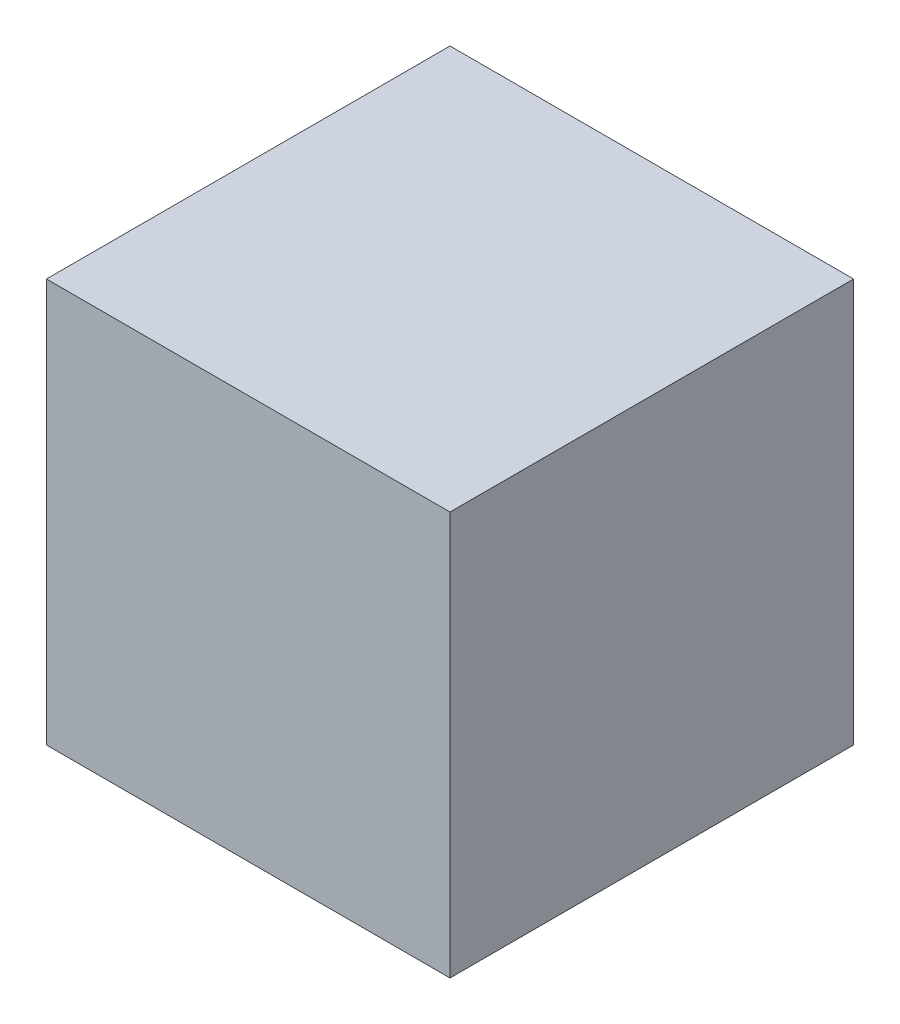
ISO-10303-21;
HEADER;
FILE_DESCRIPTION(('STEP AP214'),'2;1');
FILE_NAME('part.step','',(''),(''),'','','');
FILE_SCHEMA(('AUTOMOTIVE_DESIGN { 1 0 10303 214 1 1 1 1 }'));
ENDSEC;
DATA;
#1=APPLICATION_CONTEXT('core data for automotive mechanical design processes');
#2=APPLICATION_PROTOCOL_DEFINITION('international standard','automotive_design',2000,#1);
#3=PRODUCT_CONTEXT('',#1,'mechanical');
#4=PRODUCT('Part','Part','',(#3));
#5=PRODUCT_RELATED_PRODUCT_CATEGORY('part','',(#4));
#6=PRODUCT_DEFINITION_FORMATION('','',#4);
#7=PRODUCT_DEFINITION_CONTEXT('part definition',#1,'design');
#8=PRODUCT_DEFINITION('design','',#6,#7);
#9=PRODUCT_DEFINITION_SHAPE('','',#8);
#10=(LENGTH_UNIT() NAMED_UNIT(*) SI_UNIT(.MILLI.,.METRE.));
#11=(NAMED_UNIT(*) PLANE_ANGLE_UNIT() SI_UNIT($,.RADIAN.));
#12=(NAMED_UNIT(*) SI_UNIT($,.STERADIAN.) SOLID_ANGLE_UNIT());
#13=UNCERTAINTY_MEASURE_WITH_UNIT(LENGTH_MEASURE(1.E-05),#10,'distance_accuracy_value','');
#14=(GEOMETRIC_REPRESENTATION_CONTEXT(3) GLOBAL_UNCERTAINTY_ASSIGNED_CONTEXT((#13)) GLOBAL_UNIT_ASSIGNED_CONTEXT((#10,
#11,#12)) REPRESENTATION_CONTEXT('',''));
#15=CARTESIAN_POINT('',(0.,0.,0.));
#16=DIRECTION('',(0.,0.,1.));
#17=DIRECTION('',(1.,0.,0.));
#18=AXIS2_PLACEMENT_3D('',#15,#16,#17);
#19=CARTESIAN_POINT('',(13.890625,27.78125,13.890625));
#20=DIRECTION('',(-1.,0.,0.));
#21=DIRECTION('',(0.,0.,1.));
#22=AXIS2_PLACEMENT_3D('',#19,#20,#21);
#23=PLANE('',#22);
#24=DIRECTION('',(0.,0.,-1.));
#25=VECTOR('',#24,1.);
#26=CARTESIAN_POINT('',(13.890625,0.,13.890625));
#27=LINE('',#26,#25);
#28=CARTESIAN_POINT('',(13.890625,0.,13.890625));
#29=VERTEX_POINT('',#28);
#30=CARTESIAN_POINT('',(13.890625,0.,-13.890625));
#31=VERTEX_POINT('',#30);
#32=EDGE_CURVE('E98',#29,#31,#27,.T.);
#33=ORIENTED_EDGE('',*,*,#32,.T.);
#34=DIRECTION('',(0.,-1.,0.));
#35=VECTOR('',#34,1.);
#36=CARTESIAN_POINT('',(13.890625,27.78125,-13.890625));
#37=LINE('',#36,#35);
#38=CARTESIAN_POINT('',(13.890625,27.78125,-13.890625));
#39=VERTEX_POINT('',#38);
#40=EDGE_CURVE('E11',#39,#31,#37,.T.);
#41=ORIENTED_EDGE('',*,*,#40,.F.);
#42=DIRECTION('',(0.,0.,-1.));
#43=VECTOR('',#42,1.);
#44=CARTESIAN_POINT('',(13.890625,27.78125,13.890625));
#45=LINE('',#44,#43);
#46=CARTESIAN_POINT('',(13.890625,27.78125,13.890625));
#47=VERTEX_POINT('',#46);
#48=EDGE_CURVE('E86',#47,#39,#45,.T.);
#49=ORIENTED_EDGE('',*,*,#48,.F.);
#50=DIRECTION('',(0.,-1.,0.));
#51=VECTOR('',#50,1.);
#52=CARTESIAN_POINT('',(13.890625,27.78125,13.890625));
#53=LINE('',#52,#51);
#54=EDGE_CURVE('E94',#47,#29,#53,.T.);
#55=ORIENTED_EDGE('',*,*,#54,.T.);
#56=EDGE_LOOP('',(#33,#41,#49,#55));
#57=FACE_BOUND('',#56,.T.);
#58=ADVANCED_FACE('F35',(#57),#23,.F.);
#59=CARTESIAN_POINT('',(-13.890625,27.78125,-13.890625));
#60=DIRECTION('',(0.,0.,1.));
#61=DIRECTION('',(1.,0.,0.));
#62=AXIS2_PLACEMENT_3D('',#59,#60,#61);
#63=PLANE('',#62);
#64=DIRECTION('',(-1.,0.,0.));
#65=VECTOR('',#64,1.);
#66=CARTESIAN_POINT('',(-13.890625,0.,-13.890625));
#67=LINE('',#66,#65);
#68=CARTESIAN_POINT('',(-13.890625,0.,-13.890625));
#69=VERTEX_POINT('',#68);
#70=EDGE_CURVE('E90',#31,#69,#67,.T.);
#71=ORIENTED_EDGE('',*,*,#70,.T.);
#72=DIRECTION('',(0.,-1.,0.));
#73=VECTOR('',#72,1.);
#74=CARTESIAN_POINT('',(-13.890625,27.78125,-13.890625));
#75=LINE('',#74,#73);
#76=CARTESIAN_POINT('',(-13.890625,27.78125,-13.890625));
#77=VERTEX_POINT('',#76);
#78=EDGE_CURVE('E43',#77,#69,#75,.T.);
#79=ORIENTED_EDGE('',*,*,#78,.F.);
#80=DIRECTION('',(-1.,0.,0.));
#81=VECTOR('',#80,1.);
#82=CARTESIAN_POINT('',(-13.890625,27.78125,-13.890625));
#83=LINE('',#82,#81);
#84=EDGE_CURVE('E81',#39,#77,#83,.T.);
#85=ORIENTED_EDGE('',*,*,#84,.F.);
#86=ORIENTED_EDGE('',*,*,#40,.T.);
#87=EDGE_LOOP('',(#71,#79,#85,#86));
#88=FACE_BOUND('',#87,.T.);
#89=ADVANCED_FACE('F89',(#88),#63,.F.);
#90=CARTESIAN_POINT('',(-13.890625,27.78125,13.890625));
#91=DIRECTION('',(1.,0.,0.));
#92=DIRECTION('',(0.,0.,-1.));
#93=AXIS2_PLACEMENT_3D('',#90,#91,#92);
#94=PLANE('',#93);
#95=DIRECTION('',(0.,0.,1.));
#96=VECTOR('',#95,1.);
#97=CARTESIAN_POINT('',(-13.890625,0.,13.890625));
#98=LINE('',#97,#96);
#99=CARTESIAN_POINT('',(-13.890625,0.,13.890625));
#100=VERTEX_POINT('',#99);
#101=EDGE_CURVE('E68',#69,#100,#98,.T.);
#102=ORIENTED_EDGE('',*,*,#101,.T.);
#103=DIRECTION('',(0.,-1.,0.));
#104=VECTOR('',#103,1.);
#105=CARTESIAN_POINT('',(-13.890625,27.78125,13.890625));
#106=LINE('',#105,#104);
#107=CARTESIAN_POINT('',(-13.890625,27.78125,13.890625));
#108=VERTEX_POINT('',#107);
#109=EDGE_CURVE('E91',#108,#100,#106,.T.);
#110=ORIENTED_EDGE('',*,*,#109,.F.);
#111=DIRECTION('',(0.,0.,1.));
#112=VECTOR('',#111,1.);
#113=CARTESIAN_POINT('',(-13.890625,27.78125,13.890625));
#114=LINE('',#113,#112);
#115=EDGE_CURVE('E84',#77,#108,#114,.T.);
#116=ORIENTED_EDGE('',*,*,#115,.F.);
#117=ORIENTED_EDGE('',*,*,#78,.T.);
#118=EDGE_LOOP('',(#102,#110,#116,#117));
#119=FACE_BOUND('',#118,.T.);
#120=ADVANCED_FACE('F92',(#119),#94,.F.);
#121=CARTESIAN_POINT('',(-13.890625,27.78125,13.890625));
#122=DIRECTION('',(0.,0.,-1.));
#123=DIRECTION('',(-1.,0.,0.));
#124=AXIS2_PLACEMENT_3D('',#121,#122,#123);
#125=PLANE('',#124);
#126=DIRECTION('',(1.,0.,0.));
#127=VECTOR('',#126,1.);
#128=CARTESIAN_POINT('',(-13.890625,0.,13.890625));
#129=LINE('',#128,#127);
#130=EDGE_CURVE('E74',#100,#29,#129,.T.);
#131=ORIENTED_EDGE('',*,*,#130,.T.);
#132=ORIENTED_EDGE('',*,*,#54,.F.);
#133=DIRECTION('',(1.,0.,0.));
#134=VECTOR('',#133,1.);
#135=CARTESIAN_POINT('',(-13.890625,27.78125,13.890625));
#136=LINE('',#135,#134);
#137=EDGE_CURVE('E51',#108,#47,#136,.T.);
#138=ORIENTED_EDGE('',*,*,#137,.F.);
#139=ORIENTED_EDGE('',*,*,#109,.T.);
#140=EDGE_LOOP('',(#131,#132,#138,#139));
#141=FACE_BOUND('',#140,.T.);
#142=ADVANCED_FACE('F105',(#141),#125,.F.);
#143=CARTESIAN_POINT('',(0.,27.78125,0.));
#144=DIRECTION('',(0.,-1.,0.));
#145=DIRECTION('',(0.,0.,-1.));
#146=AXIS2_PLACEMENT_3D('',#143,#144,#145);
#147=PLANE('',#146);
#148=ORIENTED_EDGE('',*,*,#48,.T.);
#149=ORIENTED_EDGE('',*,*,#84,.T.);
#150=ORIENTED_EDGE('',*,*,#115,.T.);
#151=ORIENTED_EDGE('',*,*,#137,.T.);
#152=EDGE_LOOP('',(#148,#149,#150,#151));
#153=FACE_BOUND('',#152,.T.);
#154=ADVANCED_FACE('F82',(#153),#147,.F.);
#155=CARTESIAN_POINT('',(0.,0.,0.));
#156=DIRECTION('',(0.,-1.,0.));
#157=DIRECTION('',(0.,0.,-1.));
#158=AXIS2_PLACEMENT_3D('',#155,#156,#157);
#159=PLANE('',#158);
#160=ORIENTED_EDGE('',*,*,#32,.F.);
#161=ORIENTED_EDGE('',*,*,#130,.F.);
#162=ORIENTED_EDGE('',*,*,#101,.F.);
#163=ORIENTED_EDGE('',*,*,#70,.F.);
#164=EDGE_LOOP('',(#160,#161,#162,#163));
#165=FACE_BOUND('',#164,.T.);
#166=ADVANCED_FACE('F108',(#165),#159,.T.);
#167=CLOSED_SHELL('',(#58,#89,#120,#142,#154,#166));
#168=MANIFOLD_SOLID_BREP('B2',#167);
#169=ADVANCED_BREP_SHAPE_REPRESENTATION('',(#18,#168),#14);
#170=SHAPE_DEFINITION_REPRESENTATION(#9,#169);
ENDSEC;
END-ISO-10303-21;
